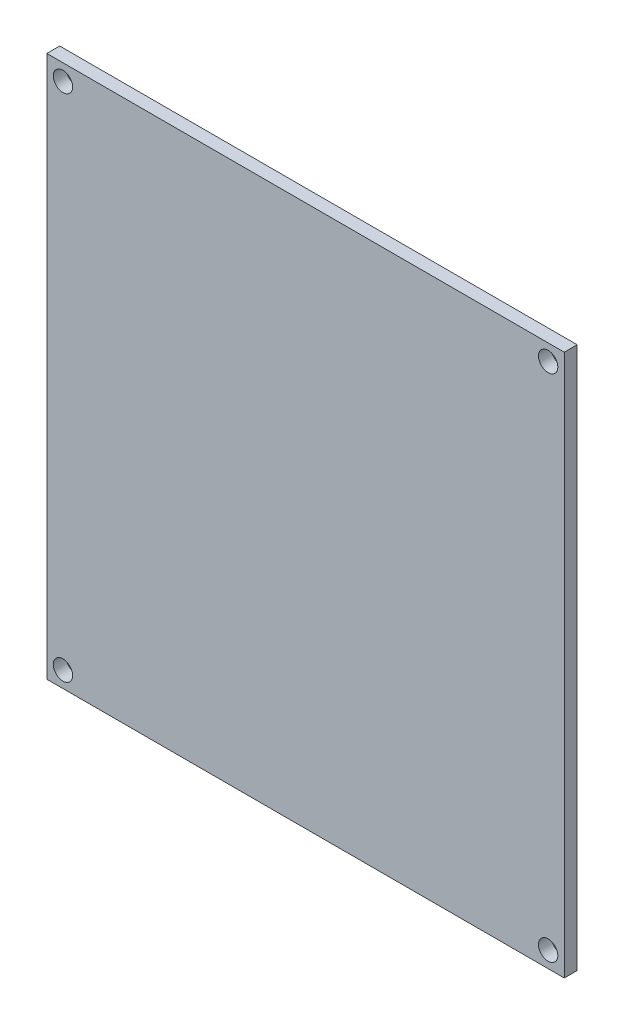
ISO-10303-21;
HEADER;
FILE_DESCRIPTION(('STEP AP214'),'2;1');
FILE_NAME('part.step','',(''),(''),'','','');
FILE_SCHEMA(('AUTOMOTIVE_DESIGN { 1 0 10303 214 1 1 1 1 }'));
ENDSEC;
DATA;
#1=APPLICATION_CONTEXT('core data for automotive mechanical design processes');
#2=APPLICATION_PROTOCOL_DEFINITION('international standard','automotive_design',2000,#1);
#3=PRODUCT_CONTEXT('',#1,'mechanical');
#4=PRODUCT('Part','Part','',(#3));
#5=PRODUCT_RELATED_PRODUCT_CATEGORY('part','',(#4));
#6=PRODUCT_DEFINITION_FORMATION('','',#4);
#7=PRODUCT_DEFINITION_CONTEXT('part definition',#1,'design');
#8=PRODUCT_DEFINITION('design','',#6,#7);
#9=PRODUCT_DEFINITION_SHAPE('','',#8);
#10=(LENGTH_UNIT() NAMED_UNIT(*) SI_UNIT(.MILLI.,.METRE.));
#11=(NAMED_UNIT(*) PLANE_ANGLE_UNIT() SI_UNIT($,.RADIAN.));
#12=(NAMED_UNIT(*) SI_UNIT($,.STERADIAN.) SOLID_ANGLE_UNIT());
#13=UNCERTAINTY_MEASURE_WITH_UNIT(LENGTH_MEASURE(1.E-05),#10,'distance_accuracy_value','');
#14=(GEOMETRIC_REPRESENTATION_CONTEXT(3) GLOBAL_UNCERTAINTY_ASSIGNED_CONTEXT((#13)) GLOBAL_UNIT_ASSIGNED_CONTEXT((#10,
#11,#12)) REPRESENTATION_CONTEXT('',''));
#15=CARTESIAN_POINT('',(0.,0.,0.));
#16=DIRECTION('',(0.,0.,1.));
#17=DIRECTION('',(1.,0.,0.));
#18=AXIS2_PLACEMENT_3D('',#15,#16,#17);
#19=CARTESIAN_POINT('',(0.,0.,2.));
#20=DIRECTION('',(-1.,0.,0.));
#21=DIRECTION('',(0.,-1.,0.));
#22=AXIS2_PLACEMENT_3D('',#19,#20,#21);
#23=PLANE('',#22);
#24=DIRECTION('',(0.,1.,0.));
#25=VECTOR('',#24,1.);
#26=CARTESIAN_POINT('',(0.,0.,0.));
#27=LINE('',#26,#25);
#28=CARTESIAN_POINT('',(0.,-84.,0.));
#29=VERTEX_POINT('',#28);
#30=CARTESIAN_POINT('',(0.,0.,0.));
#31=VERTEX_POINT('',#30);
#32=EDGE_CURVE('E105',#29,#31,#27,.T.);
#33=ORIENTED_EDGE('',*,*,#32,.T.);
#34=DIRECTION('',(0.,0.,-1.));
#35=VECTOR('',#34,1.);
#36=CARTESIAN_POINT('',(0.,0.,2.));
#37=LINE('',#36,#35);
#38=CARTESIAN_POINT('',(0.,0.,2.));
#39=VERTEX_POINT('',#38);
#40=EDGE_CURVE('E11',#39,#31,#37,.T.);
#41=ORIENTED_EDGE('',*,*,#40,.F.);
#42=DIRECTION('',(0.,1.,0.));
#43=VECTOR('',#42,1.);
#44=CARTESIAN_POINT('',(0.,0.,2.));
#45=LINE('',#44,#43);
#46=CARTESIAN_POINT('',(0.,-84.,2.));
#47=VERTEX_POINT('',#46);
#48=EDGE_CURVE('E92',#47,#39,#45,.T.);
#49=ORIENTED_EDGE('',*,*,#48,.F.);
#50=DIRECTION('',(0.,0.,-1.));
#51=VECTOR('',#50,1.);
#52=CARTESIAN_POINT('',(0.,-84.,2.));
#53=LINE('',#52,#51);
#54=EDGE_CURVE('E101',#47,#29,#53,.T.);
#55=ORIENTED_EDGE('',*,*,#54,.T.);
#56=EDGE_LOOP('',(#33,#41,#49,#55));
#57=FACE_BOUND('',#56,.T.);
#58=ADVANCED_FACE('F39',(#57),#23,.F.);
#59=CARTESIAN_POINT('',(0.,0.,2.));
#60=DIRECTION('',(0.,-1.,0.));
#61=DIRECTION('',(1.,0.,0.));
#62=AXIS2_PLACEMENT_3D('',#59,#60,#61);
#63=PLANE('',#62);
#64=DIRECTION('',(-1.,0.,0.));
#65=VECTOR('',#64,1.);
#66=CARTESIAN_POINT('',(0.,0.,0.));
#67=LINE('',#66,#65);
#68=CARTESIAN_POINT('',(-80.2,0.,0.));
#69=VERTEX_POINT('',#68);
#70=EDGE_CURVE('E96',#31,#69,#67,.T.);
#71=ORIENTED_EDGE('',*,*,#70,.T.);
#72=DIRECTION('',(0.,0.,-1.));
#73=VECTOR('',#72,1.);
#74=CARTESIAN_POINT('',(-80.2,0.,2.));
#75=LINE('',#74,#73);
#76=CARTESIAN_POINT('',(-80.2,0.,2.));
#77=VERTEX_POINT('',#76);
#78=EDGE_CURVE('E48',#77,#69,#75,.T.);
#79=ORIENTED_EDGE('',*,*,#78,.F.);
#80=DIRECTION('',(-1.,0.,0.));
#81=VECTOR('',#80,1.);
#82=CARTESIAN_POINT('',(0.,0.,2.));
#83=LINE('',#82,#81);
#84=EDGE_CURVE('E87',#39,#77,#83,.T.);
#85=ORIENTED_EDGE('',*,*,#84,.F.);
#86=ORIENTED_EDGE('',*,*,#40,.T.);
#87=EDGE_LOOP('',(#71,#79,#85,#86));
#88=FACE_BOUND('',#87,.T.);
#89=ADVANCED_FACE('F95',(#88),#63,.F.);
#90=CARTESIAN_POINT('',(-80.2,0.,2.));
#91=DIRECTION('',(1.,0.,0.));
#92=DIRECTION('',(0.,1.,0.));
#93=AXIS2_PLACEMENT_3D('',#90,#91,#92);
#94=PLANE('',#93);
#95=DIRECTION('',(0.,-1.,0.));
#96=VECTOR('',#95,1.);
#97=CARTESIAN_POINT('',(-80.2,0.,0.));
#98=LINE('',#97,#96);
#99=CARTESIAN_POINT('',(-80.2,-84.,0.));
#100=VERTEX_POINT('',#99);
#101=EDGE_CURVE('E74',#69,#100,#98,.T.);
#102=ORIENTED_EDGE('',*,*,#101,.T.);
#103=DIRECTION('',(0.,0.,-1.));
#104=VECTOR('',#103,1.);
#105=CARTESIAN_POINT('',(-80.2,-84.,2.));
#106=LINE('',#105,#104);
#107=CARTESIAN_POINT('',(-80.2,-84.,2.));
#108=VERTEX_POINT('',#107);
#109=EDGE_CURVE('E97',#108,#100,#106,.T.);
#110=ORIENTED_EDGE('',*,*,#109,.F.);
#111=DIRECTION('',(0.,-1.,0.));
#112=VECTOR('',#111,1.);
#113=CARTESIAN_POINT('',(-80.2,0.,2.));
#114=LINE('',#113,#112);
#115=EDGE_CURVE('E90',#77,#108,#114,.T.);
#116=ORIENTED_EDGE('',*,*,#115,.F.);
#117=ORIENTED_EDGE('',*,*,#78,.T.);
#118=EDGE_LOOP('',(#102,#110,#116,#117));
#119=FACE_BOUND('',#118,.T.);
#120=ADVANCED_FACE('F99',(#119),#94,.F.);
#121=CARTESIAN_POINT('',(0.,-84.,2.));
#122=DIRECTION('',(0.,1.,0.));
#123=DIRECTION('',(-1.,0.,0.));
#124=AXIS2_PLACEMENT_3D('',#121,#122,#123);
#125=PLANE('',#124);
#126=DIRECTION('',(1.,0.,0.));
#127=VECTOR('',#126,1.);
#128=CARTESIAN_POINT('',(0.,-84.,0.));
#129=LINE('',#128,#127);
#130=EDGE_CURVE('E80',#100,#29,#129,.T.);
#131=ORIENTED_EDGE('',*,*,#130,.T.);
#132=ORIENTED_EDGE('',*,*,#54,.F.);
#133=DIRECTION('',(1.,0.,0.));
#134=VECTOR('',#133,1.);
#135=CARTESIAN_POINT('',(0.,-84.,2.));
#136=LINE('',#135,#134);
#137=EDGE_CURVE('E57',#108,#47,#136,.T.);
#138=ORIENTED_EDGE('',*,*,#137,.F.);
#139=ORIENTED_EDGE('',*,*,#109,.T.);
#140=EDGE_LOOP('',(#131,#132,#138,#139));
#141=FACE_BOUND('',#140,.T.);
#142=ADVANCED_FACE('F141',(#141),#125,.F.);
#143=CARTESIAN_POINT('',(0.,0.,2.));
#144=DIRECTION('',(0.,0.,-1.));
#145=DIRECTION('',(-1.,0.,0.));
#146=AXIS2_PLACEMENT_3D('',#143,#144,#145);
#147=PLANE('',#146);
#148=CARTESIAN_POINT('',(-2.49999999999999,-2.49999999999999,2.));
#149=DIRECTION('',(0.,0.,1.));
#150=DIRECTION('',(-1.,0.,0.));
#151=AXIS2_PLACEMENT_3D('',#148,#149,#150);
#152=CIRCLE('',#151,1.5);
#153=CARTESIAN_POINT('',(-3.99999999999999,-2.49999999999999,2.));
#154=VERTEX_POINT('',#153);
#155=EDGE_CURVE('E268',#154,#154,#152,.T.);
#156=ORIENTED_EDGE('',*,*,#155,.F.);
#157=EDGE_LOOP('',(#156));
#158=FACE_BOUND('',#157,.T.);
#159=CARTESIAN_POINT('',(-77.7,-81.5,2.));
#160=DIRECTION('',(0.,0.,1.));
#161=DIRECTION('',(-1.,0.,0.));
#162=AXIS2_PLACEMENT_3D('',#159,#160,#161);
#163=CIRCLE('',#162,1.5);
#164=CARTESIAN_POINT('',(-79.2,-81.5,2.));
#165=VERTEX_POINT('',#164);
#166=EDGE_CURVE('E266',#165,#165,#163,.T.);
#167=ORIENTED_EDGE('',*,*,#166,.F.);
#168=EDGE_LOOP('',(#167));
#169=FACE_BOUND('',#168,.T.);
#170=CARTESIAN_POINT('',(-2.49999999999998,-81.5,2.));
#171=DIRECTION('',(0.,0.,1.));
#172=DIRECTION('',(1.,0.,0.));
#173=AXIS2_PLACEMENT_3D('',#170,#171,#172);
#174=CIRCLE('',#173,1.5);
#175=CARTESIAN_POINT('',(-0.99999999999998,-81.5,2.));
#176=VERTEX_POINT('',#175);
#177=EDGE_CURVE('E269',#176,#176,#174,.T.);
#178=ORIENTED_EDGE('',*,*,#177,.F.);
#179=EDGE_LOOP('',(#178));
#180=FACE_BOUND('',#179,.T.);
#181=CARTESIAN_POINT('',(-77.7,-2.5,2.));
#182=DIRECTION('',(0.,0.,1.));
#183=DIRECTION('',(1.,0.,0.));
#184=AXIS2_PLACEMENT_3D('',#181,#182,#183);
#185=CIRCLE('',#184,1.5);
#186=CARTESIAN_POINT('',(-76.2,-2.5,2.));
#187=VERTEX_POINT('',#186);
#188=EDGE_CURVE('E117',#187,#187,#185,.T.);
#189=ORIENTED_EDGE('',*,*,#188,.F.);
#190=EDGE_LOOP('',(#189));
#191=FACE_BOUND('',#190,.T.);
#192=ORIENTED_EDGE('',*,*,#48,.T.);
#193=ORIENTED_EDGE('',*,*,#84,.T.);
#194=ORIENTED_EDGE('',*,*,#115,.T.);
#195=ORIENTED_EDGE('',*,*,#137,.T.);
#196=EDGE_LOOP('',(#192,#193,#194,#195));
#197=FACE_BOUND('',#196,.T.);
#198=ADVANCED_FACE('F88',(#158,#169,#180,#191,#197),#147,.F.);
#199=CARTESIAN_POINT('',(0.,0.,0.));
#200=DIRECTION('',(0.,0.,-1.));
#201=DIRECTION('',(-1.,0.,0.));
#202=AXIS2_PLACEMENT_3D('',#199,#200,#201);
#203=PLANE('',#202);
#204=CARTESIAN_POINT('',(-2.49999999999999,-2.49999999999999,0.));
#205=DIRECTION('',(0.,0.,-1.));
#206=DIRECTION('',(-1.,0.,0.));
#207=AXIS2_PLACEMENT_3D('',#204,#205,#206);
#208=CIRCLE('',#207,1.5);
#209=CARTESIAN_POINT('',(-3.99999999999999,-2.49999999999999,0.));
#210=VERTEX_POINT('',#209);
#211=EDGE_CURVE('E42',#210,#210,#208,.T.);
#212=ORIENTED_EDGE('',*,*,#211,.F.);
#213=EDGE_LOOP('',(#212));
#214=FACE_BOUND('',#213,.T.);
#215=CARTESIAN_POINT('',(-77.7,-81.5,0.));
#216=DIRECTION('',(0.,0.,-1.));
#217=DIRECTION('',(-1.,0.,0.));
#218=AXIS2_PLACEMENT_3D('',#215,#216,#217);
#219=CIRCLE('',#218,1.5);
#220=CARTESIAN_POINT('',(-79.2,-81.5,0.));
#221=VERTEX_POINT('',#220);
#222=EDGE_CURVE('E119',#221,#221,#219,.T.);
#223=ORIENTED_EDGE('',*,*,#222,.F.);
#224=EDGE_LOOP('',(#223));
#225=FACE_BOUND('',#224,.T.);
#226=CARTESIAN_POINT('',(-2.49999999999998,-81.5,0.));
#227=DIRECTION('',(0.,0.,-1.));
#228=DIRECTION('',(-1.,0.,0.));
#229=AXIS2_PLACEMENT_3D('',#226,#227,#228);
#230=CIRCLE('',#229,1.5);
#231=CARTESIAN_POINT('',(-3.99999999999998,-81.5,0.));
#232=VERTEX_POINT('',#231);
#233=EDGE_CURVE('E116',#232,#232,#230,.T.);
#234=ORIENTED_EDGE('',*,*,#233,.F.);
#235=EDGE_LOOP('',(#234));
#236=FACE_BOUND('',#235,.T.);
#237=CARTESIAN_POINT('',(-77.7,-2.5,0.));
#238=DIRECTION('',(0.,0.,-1.));
#239=DIRECTION('',(-1.,0.,0.));
#240=AXIS2_PLACEMENT_3D('',#237,#238,#239);
#241=CIRCLE('',#240,1.5);
#242=CARTESIAN_POINT('',(-79.2,-2.5,0.));
#243=VERTEX_POINT('',#242);
#244=EDGE_CURVE('E113',#243,#243,#241,.T.);
#245=ORIENTED_EDGE('',*,*,#244,.F.);
#246=EDGE_LOOP('',(#245));
#247=FACE_BOUND('',#246,.T.);
#248=ORIENTED_EDGE('',*,*,#32,.F.);
#249=ORIENTED_EDGE('',*,*,#130,.F.);
#250=ORIENTED_EDGE('',*,*,#101,.F.);
#251=ORIENTED_EDGE('',*,*,#70,.F.);
#252=EDGE_LOOP('',(#248,#249,#250,#251));
#253=FACE_BOUND('',#252,.T.);
#254=ADVANCED_FACE('F129',(#214,#225,#236,#247,#253),#203,.T.);
#255=CARTESIAN_POINT('',(-77.7,-2.5,-40.));
#256=DIRECTION('',(0.,0.,1.));
#257=DIRECTION('',(1.,0.,0.));
#258=AXIS2_PLACEMENT_3D('',#255,#256,#257);
#259=CYLINDRICAL_SURFACE('',#258,1.5);
#260=ORIENTED_EDGE('',*,*,#244,.T.);
#261=EDGE_LOOP('',(#260));
#262=FACE_BOUND('',#261,.T.);
#263=ORIENTED_EDGE('',*,*,#188,.T.);
#264=EDGE_LOOP('',(#263));
#265=FACE_BOUND('',#264,.T.);
#266=ADVANCED_FACE('F132',(#262,#265),#259,.F.);
#267=CARTESIAN_POINT('',(-2.49999999999998,-81.5,-40.));
#268=DIRECTION('',(0.,0.,1.));
#269=DIRECTION('',(1.,0.,0.));
#270=AXIS2_PLACEMENT_3D('',#267,#268,#269);
#271=CYLINDRICAL_SURFACE('',#270,1.5);
#272=ORIENTED_EDGE('',*,*,#233,.T.);
#273=EDGE_LOOP('',(#272));
#274=FACE_BOUND('',#273,.T.);
#275=ORIENTED_EDGE('',*,*,#177,.T.);
#276=EDGE_LOOP('',(#275));
#277=FACE_BOUND('',#276,.T.);
#278=ADVANCED_FACE('F186',(#274,#277),#271,.F.);
#279=CARTESIAN_POINT('',(-77.7,-81.5,-40.));
#280=DIRECTION('',(0.,0.,1.));
#281=DIRECTION('',(1.,0.,0.));
#282=AXIS2_PLACEMENT_3D('',#279,#280,#281);
#283=CYLINDRICAL_SURFACE('',#282,1.5);
#284=ORIENTED_EDGE('',*,*,#222,.T.);
#285=EDGE_LOOP('',(#284));
#286=FACE_BOUND('',#285,.T.);
#287=ORIENTED_EDGE('',*,*,#166,.T.);
#288=EDGE_LOOP('',(#287));
#289=FACE_BOUND('',#288,.T.);
#290=ADVANCED_FACE('F196',(#286,#289),#283,.F.);
#291=CARTESIAN_POINT('',(-2.49999999999999,-2.49999999999999,-40.));
#292=DIRECTION('',(0.,0.,1.));
#293=DIRECTION('',(1.,0.,0.));
#294=AXIS2_PLACEMENT_3D('',#291,#292,#293);
#295=CYLINDRICAL_SURFACE('',#294,1.5);
#296=ORIENTED_EDGE('',*,*,#211,.T.);
#297=EDGE_LOOP('',(#296));
#298=FACE_BOUND('',#297,.T.);
#299=ORIENTED_EDGE('',*,*,#155,.T.);
#300=EDGE_LOOP('',(#299));
#301=FACE_BOUND('',#300,.T.);
#302=ADVANCED_FACE('F126',(#298,#301),#295,.F.);
#303=CLOSED_SHELL('',(#58,#89,#120,#142,#198,#254,#266,#278,#290,#302));
#304=MANIFOLD_SOLID_BREP('B2',#303);
#305=ADVANCED_BREP_SHAPE_REPRESENTATION('',(#18,#304),#14);
#306=SHAPE_DEFINITION_REPRESENTATION(#9,#305);
ENDSEC;
END-ISO-10303-21;
